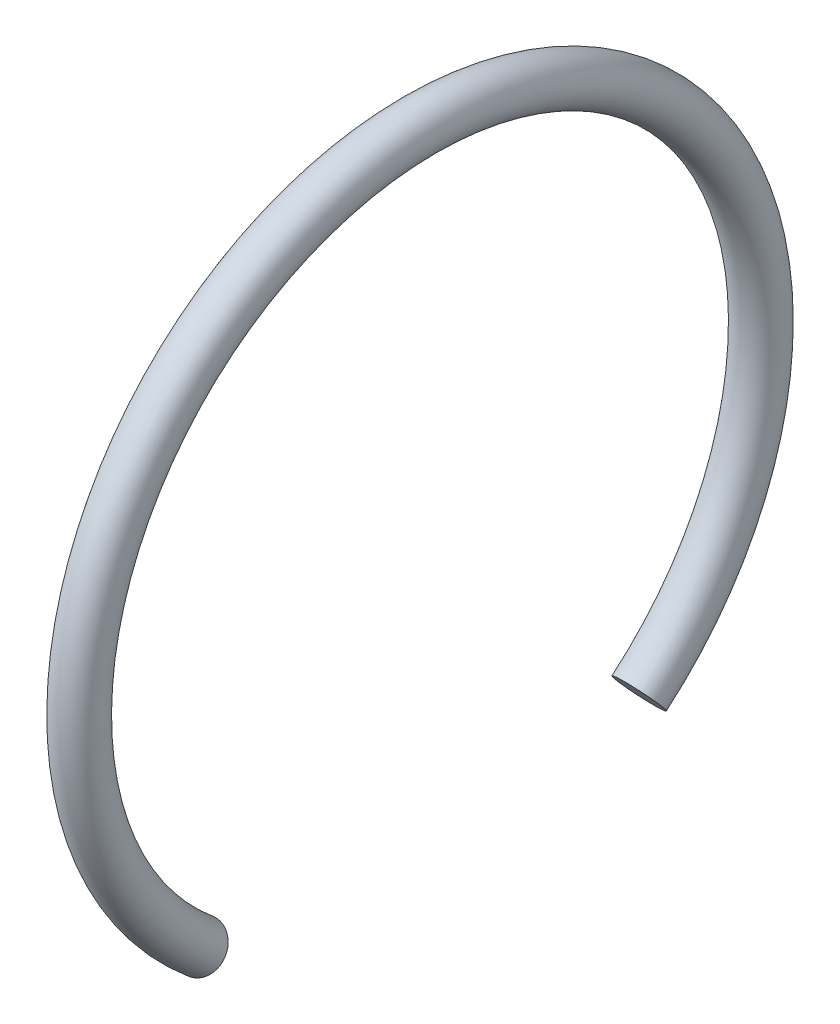
ISO-10303-21;
HEADER;
FILE_DESCRIPTION(('STEP AP214'),'2;1');
FILE_NAME('part.step','',(''),(''),'','','');
FILE_SCHEMA(('AUTOMOTIVE_DESIGN { 1 0 10303 214 1 1 1 1 }'));
ENDSEC;
DATA;
#1=APPLICATION_CONTEXT('core data for automotive mechanical design processes');
#2=APPLICATION_PROTOCOL_DEFINITION('international standard','automotive_design',2000,#1);
#3=PRODUCT_CONTEXT('',#1,'mechanical');
#4=PRODUCT('Part','Part','',(#3));
#5=PRODUCT_RELATED_PRODUCT_CATEGORY('part','',(#4));
#6=PRODUCT_DEFINITION_FORMATION('','',#4);
#7=PRODUCT_DEFINITION_CONTEXT('part definition',#1,'design');
#8=PRODUCT_DEFINITION('design','',#6,#7);
#9=PRODUCT_DEFINITION_SHAPE('','',#8);
#10=(LENGTH_UNIT() NAMED_UNIT(*) SI_UNIT(.MILLI.,.METRE.));
#11=(NAMED_UNIT(*) PLANE_ANGLE_UNIT() SI_UNIT($,.RADIAN.));
#12=(NAMED_UNIT(*) SI_UNIT($,.STERADIAN.) SOLID_ANGLE_UNIT());
#13=UNCERTAINTY_MEASURE_WITH_UNIT(LENGTH_MEASURE(1.E-05),#10,'distance_accuracy_value','');
#14=(GEOMETRIC_REPRESENTATION_CONTEXT(3) GLOBAL_UNCERTAINTY_ASSIGNED_CONTEXT((#13)) GLOBAL_UNIT_ASSIGNED_CONTEXT((#10,
#11,#12)) REPRESENTATION_CONTEXT('',''));
#15=CARTESIAN_POINT('',(0.,0.,0.));
#16=DIRECTION('',(0.,0.,1.));
#17=DIRECTION('',(1.,0.,0.));
#18=AXIS2_PLACEMENT_3D('',#15,#16,#17);
#19=CARTESIAN_POINT('',(0.,0.,0.));
#20=DIRECTION('',(0.,0.642787609686539,0.766044443118978));
#21=DIRECTION('',(0.,-0.766044443118978,0.642787609686539));
#22=AXIS2_PLACEMENT_3D('',#19,#20,#21);
#23=PLANE('',#22);
#24=CARTESIAN_POINT('',(0.,-8.5452257629922,7.17029578605334));
#25=DIRECTION('',(0.,0.642787609686538,0.766044443118979));
#26=DIRECTION('',(0.,-0.766044443118979,0.642787609686538));
#27=AXIS2_PLACEMENT_3D('',#24,#25,#26);
#28=CIRCLE('',#27,0.750000000000001);
#29=CARTESIAN_POINT('',(0.,-9.11975909533144,7.65238649331825));
#30=VERTEX_POINT('',#29);
#31=EDGE_CURVE('E19',#30,#30,#28,.T.);
#32=ORIENTED_EDGE('',*,*,#31,.F.);
#33=EDGE_LOOP('',(#32));
#34=FACE_BOUND('',#33,.T.);
#35=ADVANCED_FACE('F15',(#34),#23,.F.);
#36=CARTESIAN_POINT('',(0.,-13.1092895185363,-11.));
#37=DIRECTION('',(0.,0.642787609686539,-0.766044443118978));
#38=DIRECTION('',(0.,0.766044443118978,0.642787609686539));
#39=AXIS2_PLACEMENT_3D('',#36,#37,#38);
#40=PLANE('',#39);
#41=CARTESIAN_POINT('',(0.,-8.5452257629922,-7.17029578605335));
#42=DIRECTION('',(0.,-0.64278760968654,0.766044443118978));
#43=DIRECTION('',(0.,-0.766044443118978,-0.64278760968654));
#44=AXIS2_PLACEMENT_3D('',#41,#42,#43);
#45=CIRCLE('',#44,0.75);
#46=CARTESIAN_POINT('',(0.,-9.11975909533143,-7.65238649331826));
#47=VERTEX_POINT('',#46);
#48=EDGE_CURVE('E10',#47,#47,#45,.F.);
#49=ORIENTED_EDGE('',*,*,#48,.F.);
#50=EDGE_LOOP('',(#49));
#51=FACE_BOUND('',#50,.T.);
#52=ADVANCED_FACE('F30',(#51),#40,.F.);
#53=CARTESIAN_POINT('',(0.,0.,0.));
#54=DIRECTION('',(1.,0.,0.));
#55=DIRECTION('',(0.,0.,-1.));
#56=AXIS2_PLACEMENT_3D('',#53,#54,#55);
#57=TOROIDAL_SURFACE('',#56,11.155,0.750000000000001);
#58=CARTESIAN_POINT('',(0.,0.,0.));
#59=DIRECTION('',(1.,0.,0.));
#60=DIRECTION('',(0.,0.,-1.));
#61=AXIS2_PLACEMENT_3D('',#58,#59,#60);
#62=CIRCLE('',#61,11.905);
#63=EDGE_CURVE('',#47,#30,#62,.T.);
#64=ORIENTED_EDGE('',*,*,#48,.T.);
#65=ORIENTED_EDGE('',*,*,#31,.T.);
#66=ORIENTED_EDGE('',*,*,#63,.T.);
#67=ORIENTED_EDGE('',*,*,#63,.F.);
#68=EDGE_LOOP('',(#64,#66,#65,#67));
#69=FACE_BOUND('',#68,.T.);
#70=ADVANCED_FACE('F17',(#69),#57,.T.);
#71=CLOSED_SHELL('',(#35,#52,#70));
#72=MANIFOLD_SOLID_BREP('B1',#71);
#73=ADVANCED_BREP_SHAPE_REPRESENTATION('',(#18,#72),#14);
#74=SHAPE_DEFINITION_REPRESENTATION(#9,#73);
ENDSEC;
END-ISO-10303-21;
